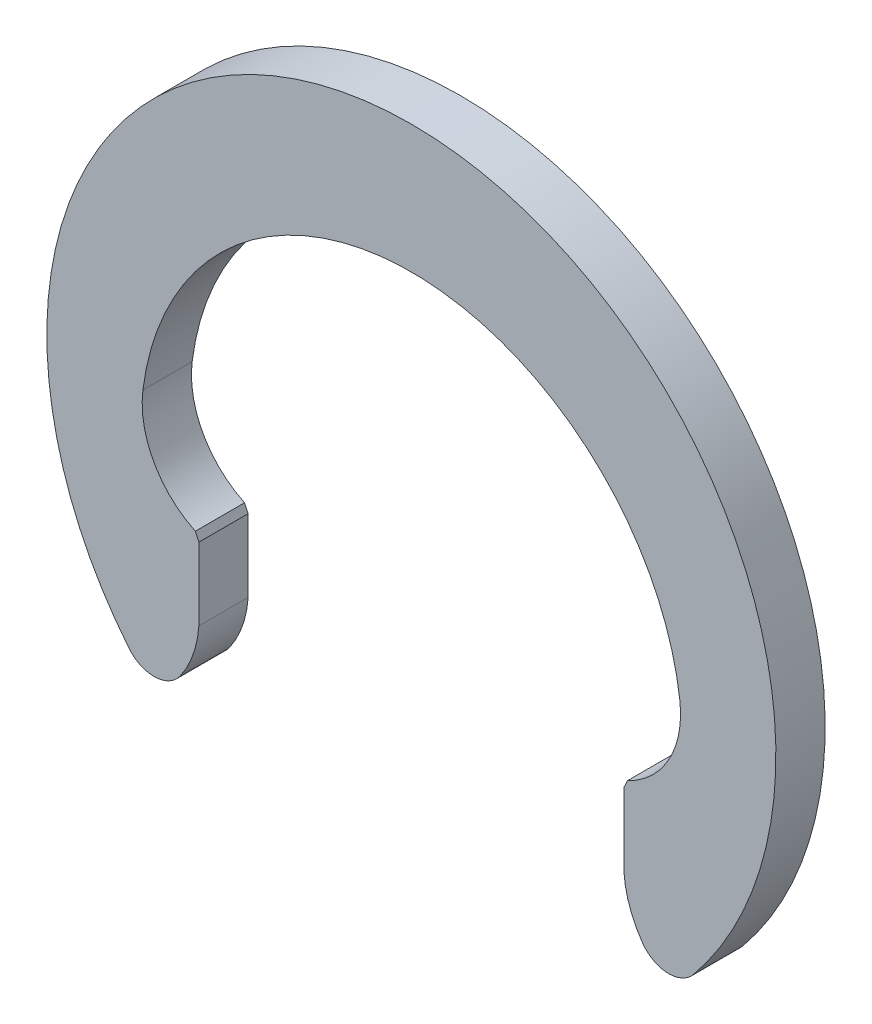
ISO-10303-21;
HEADER;
FILE_DESCRIPTION(('STEP AP214'),'2;1');
FILE_NAME('part.step','',(''),(''),'','','');
FILE_SCHEMA(('AUTOMOTIVE_DESIGN { 1 0 10303 214 1 1 1 1 }'));
ENDSEC;
DATA;
#1=APPLICATION_CONTEXT('core data for automotive mechanical design processes');
#2=APPLICATION_PROTOCOL_DEFINITION('international standard','automotive_design',2000,#1);
#3=PRODUCT_CONTEXT('',#1,'mechanical');
#4=PRODUCT('Part','Part','',(#3));
#5=PRODUCT_RELATED_PRODUCT_CATEGORY('part','',(#4));
#6=PRODUCT_DEFINITION_FORMATION('','',#4);
#7=PRODUCT_DEFINITION_CONTEXT('part definition',#1,'design');
#8=PRODUCT_DEFINITION('design','',#6,#7);
#9=PRODUCT_DEFINITION_SHAPE('','',#8);
#10=(LENGTH_UNIT() NAMED_UNIT(*) SI_UNIT(.MILLI.,.METRE.));
#11=(NAMED_UNIT(*) PLANE_ANGLE_UNIT() SI_UNIT($,.RADIAN.));
#12=(NAMED_UNIT(*) SI_UNIT($,.STERADIAN.) SOLID_ANGLE_UNIT());
#13=UNCERTAINTY_MEASURE_WITH_UNIT(LENGTH_MEASURE(1.E-05),#10,'distance_accuracy_value','');
#14=(GEOMETRIC_REPRESENTATION_CONTEXT(3) GLOBAL_UNCERTAINTY_ASSIGNED_CONTEXT((#13)) GLOBAL_UNIT_ASSIGNED_CONTEXT((#10,
#11,#12)) REPRESENTATION_CONTEXT('',''));
#15=CARTESIAN_POINT('',(0.,0.,0.));
#16=DIRECTION('',(0.,0.,1.));
#17=DIRECTION('',(1.,0.,0.));
#18=AXIS2_PLACEMENT_3D('',#15,#16,#17);
#19=CARTESIAN_POINT('',(0.,0.,-0.35));
#20=DIRECTION('',(0.,0.,1.));
#21=DIRECTION('',(1.,0.,0.));
#22=AXIS2_PLACEMENT_3D('',#19,#20,#21);
#23=PLANE('',#22);
#24=CARTESIAN_POINT('',(0.,0.,-0.35));
#25=DIRECTION('',(0.,0.,1.));
#26=DIRECTION('',(1.,0.,0.));
#27=AXIS2_PLACEMENT_3D('',#24,#25,#26);
#28=CIRCLE('',#27,3.7);
#29=CARTESIAN_POINT('',(2.86362795950369,-2.34299699307292,-0.35));
#30=VERTEX_POINT('',#29);
#31=CARTESIAN_POINT('',(-2.86362795950368,-2.34299699307293,-0.35));
#32=VERTEX_POINT('',#31);
#33=EDGE_CURVE('E130',#30,#32,#28,.T.);
#34=ORIENTED_EDGE('',*,*,#33,.F.);
#35=CARTESIAN_POINT('',(2.6120930711689,-2.13719320314084,-0.35));
#36=DIRECTION('',(0.,0.,-1.));
#37=DIRECTION('',(1.,0.,0.));
#38=AXIS2_PLACEMENT_3D('',#35,#36,#37);
#39=CIRCLE('',#38,0.325);
#40=CARTESIAN_POINT('',(2.34627823993633,-2.32418912688464,-0.35));
#41=VERTEX_POINT('',#40);
#42=EDGE_CURVE('E129',#30,#41,#39,.T.);
#43=ORIENTED_EDGE('',*,*,#42,.T.);
#44=CARTESIAN_POINT('',(3.20865351956933,-1.71752372269696,-0.35));
#45=DIRECTION('',(0.,0.,1.));
#46=DIRECTION('',(1.,0.,0.));
#47=AXIS2_PLACEMENT_3D('',#44,#45,#46);
#48=CIRCLE('',#47,1.05438799099777);
#49=CARTESIAN_POINT('',(2.15667568261897,-1.78877444989019,-0.35));
#50=VERTEX_POINT('',#49);
#51=EDGE_CURVE('E124',#50,#41,#48,.T.);
#52=ORIENTED_EDGE('',*,*,#51,.F.);
#53=DIRECTION('',(0.,-1.,0.));
#54=VECTOR('',#53,1.);
#55=CARTESIAN_POINT('',(2.15667568261898,-1.78877444989019,-0.35));
#56=LINE('',#55,#54);
#57=CARTESIAN_POINT('',(2.15667568261897,-1.05297198443263,-0.35));
#58=VERTEX_POINT('',#57);
#59=EDGE_CURVE('E11',#58,#50,#56,.T.);
#60=ORIENTED_EDGE('',*,*,#59,.F.);
#61=CARTESIAN_POINT('',(0.,0.,-0.35));
#62=DIRECTION('',(0.,0.,-1.));
#63=DIRECTION('',(-1.,0.,0.));
#64=AXIS2_PLACEMENT_3D('',#61,#62,#63);
#65=CIRCLE('',#64,2.4);
#66=CARTESIAN_POINT('',(2.19302872758202,-0.975,-0.35));
#67=VERTEX_POINT('',#66);
#68=EDGE_CURVE('E212',#67,#58,#65,.T.);
#69=ORIENTED_EDGE('',*,*,#68,.F.);
#70=CARTESIAN_POINT('',(1.78492705087858,-0.119710168645288,-0.35));
#71=DIRECTION('',(0.,0.,-1.));
#72=DIRECTION('',(-1.,0.,0.));
#73=AXIS2_PLACEMENT_3D('',#70,#71,#72);
#74=CIRCLE('',#73,0.947664325669659);
#75=CARTESIAN_POINT('',(2.725,0.,-0.35));
#76=VERTEX_POINT('',#75);
#77=EDGE_CURVE('E186',#76,#67,#74,.T.);
#78=ORIENTED_EDGE('',*,*,#77,.F.);
#79=CARTESIAN_POINT('',(0.,-0.347005208333333,-0.35));
#80=DIRECTION('',(0.,0.,-1.));
#81=DIRECTION('',(1.,0.,0.));
#82=AXIS2_PLACEMENT_3D('',#79,#80,#81);
#83=CIRCLE('',#82,2.74700520833333);
#84=CARTESIAN_POINT('',(-2.725,0.,-0.35));
#85=VERTEX_POINT('',#84);
#86=EDGE_CURVE('E164',#85,#76,#83,.T.);
#87=ORIENTED_EDGE('',*,*,#86,.F.);
#88=CARTESIAN_POINT('',(-1.78492705087858,-0.119710168645288,-0.35));
#89=DIRECTION('',(0.,0.,-1.));
#90=DIRECTION('',(1.,0.,0.));
#91=AXIS2_PLACEMENT_3D('',#88,#89,#90);
#92=CIRCLE('',#91,0.947664325669659);
#93=CARTESIAN_POINT('',(-2.19302872758202,-0.975,-0.35));
#94=VERTEX_POINT('',#93);
#95=EDGE_CURVE('E203',#94,#85,#92,.T.);
#96=ORIENTED_EDGE('',*,*,#95,.F.);
#97=CARTESIAN_POINT('',(0.,0.,-0.35));
#98=DIRECTION('',(0.,0.,-1.));
#99=DIRECTION('',(1.,0.,0.));
#100=AXIS2_PLACEMENT_3D('',#97,#98,#99);
#101=CIRCLE('',#100,2.4);
#102=CARTESIAN_POINT('',(-2.15667568261897,-1.05297198443263,-0.35));
#103=VERTEX_POINT('',#102);
#104=EDGE_CURVE('E160',#103,#94,#101,.T.);
#105=ORIENTED_EDGE('',*,*,#104,.F.);
#106=DIRECTION('',(0.,1.,0.));
#107=VECTOR('',#106,1.);
#108=CARTESIAN_POINT('',(-2.15667568261897,-1.42087321716141,-0.35));
#109=LINE('',#108,#107);
#110=CARTESIAN_POINT('',(-2.15667568261897,-1.78877444989019,-0.35));
#111=VERTEX_POINT('',#110);
#112=EDGE_CURVE('E194',#111,#103,#109,.T.);
#113=ORIENTED_EDGE('',*,*,#112,.F.);
#114=CARTESIAN_POINT('',(-3.20865351956933,-1.71752372269696,-0.35));
#115=DIRECTION('',(0.,0.,1.));
#116=DIRECTION('',(-1.,0.,0.));
#117=AXIS2_PLACEMENT_3D('',#114,#115,#116);
#118=CIRCLE('',#117,1.05438799099777);
#119=CARTESIAN_POINT('',(-2.34627823993633,-2.32418912688465,-0.35));
#120=VERTEX_POINT('',#119);
#121=EDGE_CURVE('E176',#120,#111,#118,.T.);
#122=ORIENTED_EDGE('',*,*,#121,.F.);
#123=CARTESIAN_POINT('',(-2.6120930711689,-2.13719320314084,-0.35));
#124=DIRECTION('',(0.,0.,-1.));
#125=DIRECTION('',(1.,0.,0.));
#126=AXIS2_PLACEMENT_3D('',#123,#124,#125);
#127=CIRCLE('',#126,0.325);
#128=EDGE_CURVE('E159',#120,#32,#127,.T.);
#129=ORIENTED_EDGE('',*,*,#128,.T.);
#130=EDGE_LOOP('',(#34,#43,#52,#60,#69,#78,#87,#96,#105,#113,#122,#129));
#131=FACE_BOUND('',#130,.T.);
#132=ADVANCED_FACE('F16',(#131),#23,.F.);
#133=CARTESIAN_POINT('',(2.15667568261898,-1.78877444989019,0.35));
#134=DIRECTION('',(1.,0.,0.));
#135=DIRECTION('',(0.,1.,0.));
#136=AXIS2_PLACEMENT_3D('',#133,#134,#135);
#137=PLANE('',#136);
#138=DIRECTION('',(0.,1.,0.));
#139=VECTOR('',#138,1.);
#140=CARTESIAN_POINT('',(2.15667568261897,-0.894387224945091,0.15));
#141=LINE('',#140,#139);
#142=CARTESIAN_POINT('',(2.15667568261897,-1.78877444989019,0.15));
#143=VERTEX_POINT('',#142);
#144=CARTESIAN_POINT('',(2.15667568261897,-1.05297198443263,0.15));
#145=VERTEX_POINT('',#144);
#146=EDGE_CURVE('E146',#143,#145,#141,.T.);
#147=ORIENTED_EDGE('',*,*,#146,.T.);
#148=DIRECTION('',(0.,0.,-1.));
#149=VECTOR('',#148,1.);
#150=CARTESIAN_POINT('',(2.15667568261897,-1.05297198443263,0.35));
#151=LINE('',#150,#149);
#152=EDGE_CURVE('E27',#145,#58,#151,.T.);
#153=ORIENTED_EDGE('',*,*,#152,.T.);
#154=ORIENTED_EDGE('',*,*,#59,.T.);
#155=DIRECTION('',(0.,0.,-1.));
#156=VECTOR('',#155,1.);
#157=CARTESIAN_POINT('',(2.15667568261897,-1.78877444989019,0.35));
#158=LINE('',#157,#156);
#159=EDGE_CURVE('E156',#143,#50,#158,.T.);
#160=ORIENTED_EDGE('',*,*,#159,.F.);
#161=EDGE_LOOP('',(#147,#153,#154,#160));
#162=FACE_BOUND('',#161,.T.);
#163=ADVANCED_FACE('F345',(#162),#137,.F.);
#164=CARTESIAN_POINT('',(0.,0.,0.35));
#165=DIRECTION('',(0.,0.,-1.));
#166=DIRECTION('',(-1.,0.,0.));
#167=AXIS2_PLACEMENT_3D('',#164,#165,#166);
#168=CYLINDRICAL_SURFACE('',#167,2.4);
#169=CARTESIAN_POINT('',(0.,0.,0.15));
#170=DIRECTION('',(0.,0.,1.));
#171=DIRECTION('',(-1.,0.,0.));
#172=AXIS2_PLACEMENT_3D('',#169,#170,#171);
#173=CIRCLE('',#172,2.4);
#174=CARTESIAN_POINT('',(2.19302872758202,-0.975,0.15));
#175=VERTEX_POINT('',#174);
#176=EDGE_CURVE('E177',#145,#175,#173,.T.);
#177=ORIENTED_EDGE('',*,*,#176,.T.);
#178=DIRECTION('',(0.,0.,-1.));
#179=VECTOR('',#178,1.);
#180=CARTESIAN_POINT('',(2.19302872758202,-0.975,0.35));
#181=LINE('',#180,#179);
#182=EDGE_CURVE('E190',#175,#67,#181,.T.);
#183=ORIENTED_EDGE('',*,*,#182,.T.);
#184=ORIENTED_EDGE('',*,*,#68,.T.);
#185=ORIENTED_EDGE('',*,*,#152,.F.);
#186=EDGE_LOOP('',(#177,#183,#184,#185));
#187=FACE_BOUND('',#186,.T.);
#188=ADVANCED_FACE('F318',(#187),#168,.F.);
#189=CARTESIAN_POINT('',(1.78492705087858,-0.119710168645288,0.35));
#190=DIRECTION('',(0.,0.,-1.));
#191=DIRECTION('',(0.87783762329979,-0.478958356351965,0.));
#192=AXIS2_PLACEMENT_3D('',#189,#190,#191);
#193=CYLINDRICAL_SURFACE('',#192,0.947664325669659);
#194=CARTESIAN_POINT('',(1.78492705087858,-0.119710168645288,0.15));
#195=DIRECTION('',(0.,0.,1.));
#196=DIRECTION('',(-1.,0.,0.));
#197=AXIS2_PLACEMENT_3D('',#194,#195,#196);
#198=CIRCLE('',#197,0.947664325669659);
#199=CARTESIAN_POINT('',(2.725,0.,0.15));
#200=VERTEX_POINT('',#199);
#201=EDGE_CURVE('E181',#175,#200,#198,.T.);
#202=ORIENTED_EDGE('',*,*,#201,.T.);
#203=DIRECTION('',(0.,0.,-1.));
#204=VECTOR('',#203,1.);
#205=CARTESIAN_POINT('',(2.725,0.,0.35));
#206=LINE('',#205,#204);
#207=EDGE_CURVE('E182',#200,#76,#206,.T.);
#208=ORIENTED_EDGE('',*,*,#207,.T.);
#209=ORIENTED_EDGE('',*,*,#77,.T.);
#210=ORIENTED_EDGE('',*,*,#182,.F.);
#211=EDGE_LOOP('',(#202,#208,#209,#210));
#212=FACE_BOUND('',#211,.T.);
#213=ADVANCED_FACE('F312',(#212),#193,.F.);
#214=CARTESIAN_POINT('',(0.,-0.347005208333333,0.35));
#215=DIRECTION('',(0.,0.,-1.));
#216=DIRECTION('',(-1.,0.,0.));
#217=AXIS2_PLACEMENT_3D('',#214,#215,#216);
#218=CYLINDRICAL_SURFACE('',#217,2.74700520833333);
#219=CARTESIAN_POINT('',(0.,-0.347005208333333,0.15));
#220=DIRECTION('',(0.,0.,1.));
#221=DIRECTION('',(-1.,0.,0.));
#222=AXIS2_PLACEMENT_3D('',#219,#220,#221);
#223=CIRCLE('',#222,2.74700520833333);
#224=CARTESIAN_POINT('',(-2.725,0.,0.15));
#225=VERTEX_POINT('',#224);
#226=EDGE_CURVE('E219',#200,#225,#223,.T.);
#227=ORIENTED_EDGE('',*,*,#226,.T.);
#228=DIRECTION('',(0.,0.,-1.));
#229=VECTOR('',#228,1.);
#230=CARTESIAN_POINT('',(-2.725,0.,0.35));
#231=LINE('',#230,#229);
#232=EDGE_CURVE('E165',#225,#85,#231,.T.);
#233=ORIENTED_EDGE('',*,*,#232,.T.);
#234=ORIENTED_EDGE('',*,*,#86,.T.);
#235=ORIENTED_EDGE('',*,*,#207,.F.);
#236=EDGE_LOOP('',(#227,#233,#234,#235));
#237=FACE_BOUND('',#236,.T.);
#238=ADVANCED_FACE('F317',(#237),#218,.F.);
#239=CARTESIAN_POINT('',(0.,0.,0.35));
#240=DIRECTION('',(0.,0.,-1.));
#241=DIRECTION('',(-1.,0.,0.));
#242=AXIS2_PLACEMENT_3D('',#239,#240,#241);
#243=CYLINDRICAL_SURFACE('',#242,2.4);
#244=CARTESIAN_POINT('',(0.,0.,0.15));
#245=DIRECTION('',(0.,0.,1.));
#246=DIRECTION('',(-1.,0.,0.));
#247=AXIS2_PLACEMENT_3D('',#244,#245,#246);
#248=CIRCLE('',#247,2.4);
#249=CARTESIAN_POINT('',(-2.19302872758202,-0.975,0.15));
#250=VERTEX_POINT('',#249);
#251=CARTESIAN_POINT('',(-2.15667568261897,-1.05297198443263,0.15));
#252=VERTEX_POINT('',#251);
#253=EDGE_CURVE('E229',#250,#252,#248,.T.);
#254=ORIENTED_EDGE('',*,*,#253,.T.);
#255=DIRECTION('',(0.,0.,-1.));
#256=VECTOR('',#255,1.);
#257=CARTESIAN_POINT('',(-2.15667568261897,-1.05297198443263,0.35));
#258=LINE('',#257,#256);
#259=EDGE_CURVE('E198',#252,#103,#258,.T.);
#260=ORIENTED_EDGE('',*,*,#259,.T.);
#261=ORIENTED_EDGE('',*,*,#104,.T.);
#262=DIRECTION('',(0.,0.,-1.));
#263=VECTOR('',#262,1.);
#264=CARTESIAN_POINT('',(-2.19302872758202,-0.975,0.35));
#265=LINE('',#264,#263);
#266=EDGE_CURVE('E155',#250,#94,#265,.T.);
#267=ORIENTED_EDGE('',*,*,#266,.F.);
#268=EDGE_LOOP('',(#254,#260,#261,#267));
#269=FACE_BOUND('',#268,.T.);
#270=ADVANCED_FACE('F336',(#269),#243,.F.);
#271=CARTESIAN_POINT('',(-1.78492705087858,-0.119710168645288,0.35));
#272=DIRECTION('',(0.,0.,-1.));
#273=DIRECTION('',(-1.,0.,0.));
#274=AXIS2_PLACEMENT_3D('',#271,#272,#273);
#275=CYLINDRICAL_SURFACE('',#274,0.947664325669659);
#276=CARTESIAN_POINT('',(-1.78492705087858,-0.119710168645288,0.15));
#277=DIRECTION('',(0.,0.,1.));
#278=DIRECTION('',(-1.,0.,0.));
#279=AXIS2_PLACEMENT_3D('',#276,#277,#278);
#280=CIRCLE('',#279,0.947664325669659);
#281=EDGE_CURVE('E20',#225,#250,#280,.T.);
#282=ORIENTED_EDGE('',*,*,#281,.T.);
#283=ORIENTED_EDGE('',*,*,#266,.T.);
#284=ORIENTED_EDGE('',*,*,#95,.T.);
#285=ORIENTED_EDGE('',*,*,#232,.F.);
#286=EDGE_LOOP('',(#282,#283,#284,#285));
#287=FACE_BOUND('',#286,.T.);
#288=ADVANCED_FACE('F299',(#287),#275,.F.);
#289=CARTESIAN_POINT('',(3.20865351956933,-1.71752372269696,0.35));
#290=DIRECTION('',(0.,0.,-1.));
#291=DIRECTION('',(-1.,0.,0.));
#292=AXIS2_PLACEMENT_3D('',#289,#290,#291);
#293=CYLINDRICAL_SURFACE('',#292,1.05438799099777);
#294=CARTESIAN_POINT('',(3.20865351956933,-1.71752372269696,0.15));
#295=DIRECTION('',(0.,0.,-1.));
#296=DIRECTION('',(-1.,0.,0.));
#297=AXIS2_PLACEMENT_3D('',#294,#295,#296);
#298=CIRCLE('',#297,1.05438799099777);
#299=CARTESIAN_POINT('',(2.34627823993633,-2.32418912688464,0.15));
#300=VERTEX_POINT('',#299);
#301=EDGE_CURVE('E123',#300,#143,#298,.T.);
#302=ORIENTED_EDGE('',*,*,#301,.T.);
#303=ORIENTED_EDGE('',*,*,#159,.T.);
#304=ORIENTED_EDGE('',*,*,#51,.T.);
#305=DIRECTION('',(0.,0.,1.));
#306=VECTOR('',#305,1.);
#307=CARTESIAN_POINT('',(2.34627823993633,-2.32418912688464,0.35));
#308=LINE('',#307,#306);
#309=EDGE_CURVE('E119',#41,#300,#308,.T.);
#310=ORIENTED_EDGE('',*,*,#309,.T.);
#311=EDGE_LOOP('',(#302,#303,#304,#310));
#312=FACE_BOUND('',#311,.T.);
#313=ADVANCED_FACE('F18',(#312),#293,.T.);
#314=CARTESIAN_POINT('',(2.6120930711689,-2.13719320314084,0.35));
#315=DIRECTION('',(0.,0.,-1.));
#316=DIRECTION('',(-1.,0.,0.));
#317=AXIS2_PLACEMENT_3D('',#314,#315,#316);
#318=CYLINDRICAL_SURFACE('',#317,0.325);
#319=CARTESIAN_POINT('',(2.6120930711689,-2.13719320314084,0.15));
#320=DIRECTION('',(0.,0.,-1.));
#321=DIRECTION('',(-1.,0.,0.));
#322=AXIS2_PLACEMENT_3D('',#319,#320,#321);
#323=CIRCLE('',#322,0.325);
#324=CARTESIAN_POINT('',(2.86362795950369,-2.34299699307292,0.15));
#325=VERTEX_POINT('',#324);
#326=EDGE_CURVE('E132',#325,#300,#323,.T.);
#327=ORIENTED_EDGE('',*,*,#326,.T.);
#328=ORIENTED_EDGE('',*,*,#309,.F.);
#329=ORIENTED_EDGE('',*,*,#42,.F.);
#330=DIRECTION('',(0.,0.,-1.));
#331=VECTOR('',#330,1.);
#332=CARTESIAN_POINT('',(2.86362795950369,-2.34299699307292,0.35));
#333=LINE('',#332,#331);
#334=EDGE_CURVE('E135',#325,#30,#333,.T.);
#335=ORIENTED_EDGE('',*,*,#334,.F.);
#336=EDGE_LOOP('',(#327,#328,#329,#335));
#337=FACE_BOUND('',#336,.T.);
#338=ADVANCED_FACE('F133',(#337),#318,.T.);
#339=CARTESIAN_POINT('',(0.,0.,0.35));
#340=DIRECTION('',(0.,0.,-1.));
#341=DIRECTION('',(0.,1.,0.));
#342=AXIS2_PLACEMENT_3D('',#339,#340,#341);
#343=CYLINDRICAL_SURFACE('',#342,3.7);
#344=CARTESIAN_POINT('',(0.,0.,0.15));
#345=DIRECTION('',(0.,0.,-1.));
#346=DIRECTION('',(-1.,0.,0.));
#347=AXIS2_PLACEMENT_3D('',#344,#345,#346);
#348=CIRCLE('',#347,3.7);
#349=CARTESIAN_POINT('',(-2.86362795950368,-2.34299699307293,0.15));
#350=VERTEX_POINT('',#349);
#351=EDGE_CURVE('E140',#350,#325,#348,.T.);
#352=ORIENTED_EDGE('',*,*,#351,.T.);
#353=ORIENTED_EDGE('',*,*,#334,.T.);
#354=ORIENTED_EDGE('',*,*,#33,.T.);
#355=DIRECTION('',(0.,0.,1.));
#356=VECTOR('',#355,1.);
#357=CARTESIAN_POINT('',(-2.86362795950368,-2.34299699307293,0.35));
#358=LINE('',#357,#356);
#359=EDGE_CURVE('E172',#32,#350,#358,.T.);
#360=ORIENTED_EDGE('',*,*,#359,.T.);
#361=EDGE_LOOP('',(#352,#353,#354,#360));
#362=FACE_BOUND('',#361,.T.);
#363=ADVANCED_FACE('F281',(#362),#343,.T.);
#364=CARTESIAN_POINT('',(-2.6120930711689,-2.13719320314084,0.35));
#365=DIRECTION('',(0.,0.,-1.));
#366=DIRECTION('',(-1.,0.,0.));
#367=AXIS2_PLACEMENT_3D('',#364,#365,#366);
#368=CYLINDRICAL_SURFACE('',#367,0.325);
#369=CARTESIAN_POINT('',(-2.6120930711689,-2.13719320314084,0.15));
#370=DIRECTION('',(0.,0.,-1.));
#371=DIRECTION('',(-1.,0.,0.));
#372=AXIS2_PLACEMENT_3D('',#369,#370,#371);
#373=CIRCLE('',#372,0.325);
#374=CARTESIAN_POINT('',(-2.34627823993633,-2.32418912688465,0.15));
#375=VERTEX_POINT('',#374);
#376=EDGE_CURVE('E171',#375,#350,#373,.T.);
#377=ORIENTED_EDGE('',*,*,#376,.T.);
#378=ORIENTED_EDGE('',*,*,#359,.F.);
#379=ORIENTED_EDGE('',*,*,#128,.F.);
#380=DIRECTION('',(0.,0.,-1.));
#381=VECTOR('',#380,1.);
#382=CARTESIAN_POINT('',(-2.34627823993633,-2.32418912688465,0.35));
#383=LINE('',#382,#381);
#384=EDGE_CURVE('E209',#375,#120,#383,.T.);
#385=ORIENTED_EDGE('',*,*,#384,.F.);
#386=EDGE_LOOP('',(#377,#378,#379,#385));
#387=FACE_BOUND('',#386,.T.);
#388=ADVANCED_FACE('F277',(#387),#368,.T.);
#389=CARTESIAN_POINT('',(-3.20865351956933,-1.71752372269696,0.35));
#390=DIRECTION('',(0.,0.,-1.));
#391=DIRECTION('',(-1.,0.,0.));
#392=AXIS2_PLACEMENT_3D('',#389,#390,#391);
#393=CYLINDRICAL_SURFACE('',#392,1.05438799099777);
#394=CARTESIAN_POINT('',(-3.20865351956933,-1.71752372269696,0.15));
#395=DIRECTION('',(0.,0.,-1.));
#396=DIRECTION('',(-1.,0.,0.));
#397=AXIS2_PLACEMENT_3D('',#394,#395,#396);
#398=CIRCLE('',#397,1.05438799099777);
#399=CARTESIAN_POINT('',(-2.15667568261897,-1.78877444989019,0.15));
#400=VERTEX_POINT('',#399);
#401=EDGE_CURVE('E166',#400,#375,#398,.T.);
#402=ORIENTED_EDGE('',*,*,#401,.T.);
#403=ORIENTED_EDGE('',*,*,#384,.T.);
#404=ORIENTED_EDGE('',*,*,#121,.T.);
#405=DIRECTION('',(0.,0.,-1.));
#406=VECTOR('',#405,1.);
#407=CARTESIAN_POINT('',(-2.15667568261897,-1.78877444989019,0.35));
#408=LINE('',#407,#406);
#409=EDGE_CURVE('E199',#400,#111,#408,.T.);
#410=ORIENTED_EDGE('',*,*,#409,.F.);
#411=EDGE_LOOP('',(#402,#403,#404,#410));
#412=FACE_BOUND('',#411,.T.);
#413=ADVANCED_FACE('F265',(#412),#393,.T.);
#414=CARTESIAN_POINT('',(-2.15667568261897,-1.42087321716141,0.35));
#415=DIRECTION('',(-1.,0.,0.));
#416=DIRECTION('',(0.,0.,1.));
#417=AXIS2_PLACEMENT_3D('',#414,#415,#416);
#418=PLANE('',#417);
#419=DIRECTION('',(0.,-1.,0.));
#420=VECTOR('',#419,1.);
#421=CARTESIAN_POINT('',(-2.15667568261897,-0.710436608580704,0.15));
#422=LINE('',#421,#420);
#423=EDGE_CURVE('E170',#252,#400,#422,.T.);
#424=ORIENTED_EDGE('',*,*,#423,.T.);
#425=ORIENTED_EDGE('',*,*,#409,.T.);
#426=ORIENTED_EDGE('',*,*,#112,.T.);
#427=ORIENTED_EDGE('',*,*,#259,.F.);
#428=EDGE_LOOP('',(#424,#425,#426,#427));
#429=FACE_BOUND('',#428,.T.);
#430=ADVANCED_FACE('F270',(#429),#418,.F.);
#431=CARTESIAN_POINT('',(0.,0.,0.15));
#432=DIRECTION('',(0.,0.,1.));
#433=DIRECTION('',(1.,0.,0.));
#434=AXIS2_PLACEMENT_3D('',#431,#432,#433);
#435=PLANE('',#434);
#436=ORIENTED_EDGE('',*,*,#301,.F.);
#437=ORIENTED_EDGE('',*,*,#326,.F.);
#438=ORIENTED_EDGE('',*,*,#351,.F.);
#439=ORIENTED_EDGE('',*,*,#376,.F.);
#440=ORIENTED_EDGE('',*,*,#401,.F.);
#441=ORIENTED_EDGE('',*,*,#423,.F.);
#442=ORIENTED_EDGE('',*,*,#253,.F.);
#443=ORIENTED_EDGE('',*,*,#281,.F.);
#444=ORIENTED_EDGE('',*,*,#226,.F.);
#445=ORIENTED_EDGE('',*,*,#201,.F.);
#446=ORIENTED_EDGE('',*,*,#176,.F.);
#447=ORIENTED_EDGE('',*,*,#146,.F.);
#448=EDGE_LOOP('',(#436,#437,#438,#439,#440,#441,#442,#443,#444,#445,#446,#447));
#449=FACE_BOUND('',#448,.T.);
#450=ADVANCED_FACE('F143',(#449),#435,.T.);
#451=CLOSED_SHELL('',(#132,#163,#188,#213,#238,#270,#288,#313,#338,#363,#388,#413,#430,#450));
#452=MANIFOLD_SOLID_BREP('B1',#451);
#453=ADVANCED_BREP_SHAPE_REPRESENTATION('',(#18,#452),#14);
#454=SHAPE_DEFINITION_REPRESENTATION(#9,#453);
ENDSEC;
END-ISO-10303-21;
